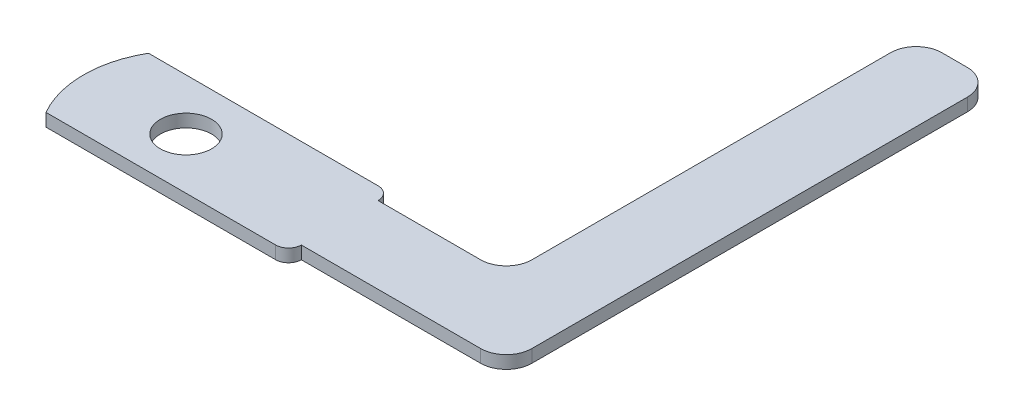
ISO-10303-21;
HEADER;
FILE_DESCRIPTION(('STEP AP214'),'2;1');
FILE_NAME('part.step','',(''),(''),'','','');
FILE_SCHEMA(('AUTOMOTIVE_DESIGN { 1 0 10303 214 1 1 1 1 }'));
ENDSEC;
DATA;
#1=APPLICATION_CONTEXT('core data for automotive mechanical design processes');
#2=APPLICATION_PROTOCOL_DEFINITION('international standard','automotive_design',2000,#1);
#3=PRODUCT_CONTEXT('',#1,'mechanical');
#4=PRODUCT('Part','Part','',(#3));
#5=PRODUCT_RELATED_PRODUCT_CATEGORY('part','',(#4));
#6=PRODUCT_DEFINITION_FORMATION('','',#4);
#7=PRODUCT_DEFINITION_CONTEXT('part definition',#1,'design');
#8=PRODUCT_DEFINITION('design','',#6,#7);
#9=PRODUCT_DEFINITION_SHAPE('','',#8);
#10=(LENGTH_UNIT() NAMED_UNIT(*) SI_UNIT(.MILLI.,.METRE.));
#11=(NAMED_UNIT(*) PLANE_ANGLE_UNIT() SI_UNIT($,.RADIAN.));
#12=(NAMED_UNIT(*) SI_UNIT($,.STERADIAN.) SOLID_ANGLE_UNIT());
#13=UNCERTAINTY_MEASURE_WITH_UNIT(LENGTH_MEASURE(1.E-05),#10,'distance_accuracy_value','');
#14=(GEOMETRIC_REPRESENTATION_CONTEXT(3) GLOBAL_UNCERTAINTY_ASSIGNED_CONTEXT((#13)) GLOBAL_UNIT_ASSIGNED_CONTEXT((#10,
#11,#12)) REPRESENTATION_CONTEXT('',''));
#15=CARTESIAN_POINT('',(0.,0.,0.));
#16=DIRECTION('',(0.,0.,1.));
#17=DIRECTION('',(1.,0.,0.));
#18=AXIS2_PLACEMENT_3D('',#15,#16,#17);
#19=CARTESIAN_POINT('',(0.,1.5875,-12.7));
#20=DIRECTION('',(0.,0.,1.));
#21=DIRECTION('',(1.,0.,0.));
#22=AXIS2_PLACEMENT_3D('',#19,#20,#21);
#23=PLANE('',#22);
#24=DIRECTION('',(-1.,0.,0.));
#25=VECTOR('',#24,1.);
#26=CARTESIAN_POINT('',(0.,1.5875,-12.7));
#27=LINE('',#26,#25);
#28=CARTESIAN_POINT('',(11.1125,1.5875,-12.7));
#29=VERTEX_POINT('',#28);
#30=CARTESIAN_POINT('',(-17.3485226280624,1.5875,-12.7));
#31=VERTEX_POINT('',#30);
#32=EDGE_CURVE('E143',#29,#31,#27,.T.);
#33=ORIENTED_EDGE('',*,*,#32,.F.);
#34=DIRECTION('',(0.,-1.,0.));
#35=VECTOR('',#34,1.);
#36=CARTESIAN_POINT('',(11.1125,0.,-12.7));
#37=LINE('',#36,#35);
#38=CARTESIAN_POINT('',(11.1125,0.,-12.7));
#39=VERTEX_POINT('',#38);
#40=EDGE_CURVE('E11',#29,#39,#37,.T.);
#41=ORIENTED_EDGE('',*,*,#40,.T.);
#42=DIRECTION('',(-1.,0.,0.));
#43=VECTOR('',#42,1.);
#44=CARTESIAN_POINT('',(0.,0.,-12.7));
#45=LINE('',#44,#43);
#46=CARTESIAN_POINT('',(-17.3485226280624,0.,-12.7));
#47=VERTEX_POINT('',#46);
#48=EDGE_CURVE('E165',#39,#47,#45,.T.);
#49=ORIENTED_EDGE('',*,*,#48,.T.);
#50=DIRECTION('',(0.,-1.,0.));
#51=VECTOR('',#50,1.);
#52=CARTESIAN_POINT('',(-17.3485226280624,1.5875,-12.7));
#53=LINE('',#52,#51);
#54=EDGE_CURVE('E158',#31,#47,#53,.T.);
#55=ORIENTED_EDGE('',*,*,#54,.F.);
#56=EDGE_LOOP('',(#33,#41,#49,#55));
#57=FACE_BOUND('',#56,.T.);
#58=ADVANCED_FACE('F41',(#57),#23,.F.);
#59=CARTESIAN_POINT('',(-6.35,1.5875,-6.35));
#60=DIRECTION('',(0.,-1.,0.));
#61=DIRECTION('',(0.,0.,-1.));
#62=AXIS2_PLACEMENT_3D('',#59,#60,#61);
#63=CYLINDRICAL_SURFACE('',#62,12.7);
#64=CARTESIAN_POINT('',(-6.35,0.,-6.35));
#65=DIRECTION('',(0.,1.,0.));
#66=DIRECTION('',(0.,0.,1.));
#67=AXIS2_PLACEMENT_3D('',#64,#65,#66);
#68=CIRCLE('',#67,12.7);
#69=CARTESIAN_POINT('',(-17.3485226280624,0.,0.));
#70=VERTEX_POINT('',#69);
#71=EDGE_CURVE('E282',#47,#70,#68,.T.);
#72=ORIENTED_EDGE('',*,*,#71,.T.);
#73=DIRECTION('',(0.,-1.,0.));
#74=VECTOR('',#73,1.);
#75=CARTESIAN_POINT('',(-17.3485226280624,1.5875,0.));
#76=LINE('',#75,#74);
#77=CARTESIAN_POINT('',(-17.3485226280624,1.5875,0.));
#78=VERTEX_POINT('',#77);
#79=EDGE_CURVE('E160',#78,#70,#76,.T.);
#80=ORIENTED_EDGE('',*,*,#79,.F.);
#81=CARTESIAN_POINT('',(-6.35,1.5875,-6.35));
#82=DIRECTION('',(0.,1.,0.));
#83=DIRECTION('',(0.,0.,1.));
#84=AXIS2_PLACEMENT_3D('',#81,#82,#83);
#85=CIRCLE('',#84,12.7);
#86=EDGE_CURVE('E146',#31,#78,#85,.T.);
#87=ORIENTED_EDGE('',*,*,#86,.F.);
#88=ORIENTED_EDGE('',*,*,#54,.T.);
#89=EDGE_LOOP('',(#72,#80,#87,#88));
#90=FACE_BOUND('',#89,.T.);
#91=ADVANCED_FACE('F157',(#90),#63,.T.);
#92=CARTESIAN_POINT('',(0.,1.5875,0.));
#93=DIRECTION('',(0.,0.,1.));
#94=DIRECTION('',(1.,0.,0.));
#95=AXIS2_PLACEMENT_3D('',#92,#93,#94);
#96=PLANE('',#95);
#97=DIRECTION('',(-1.,0.,0.));
#98=VECTOR('',#97,1.);
#99=CARTESIAN_POINT('',(0.,0.,0.));
#100=LINE('',#99,#98);
#101=CARTESIAN_POINT('',(11.1125,0.,0.));
#102=VERTEX_POINT('',#101);
#103=EDGE_CURVE('E279',#102,#70,#100,.T.);
#104=ORIENTED_EDGE('',*,*,#103,.F.);
#105=DIRECTION('',(0.,-1.,0.));
#106=VECTOR('',#105,1.);
#107=CARTESIAN_POINT('',(11.1125,1.5875,0.));
#108=LINE('',#107,#106);
#109=CARTESIAN_POINT('',(11.1125,1.5875,0.));
#110=VERTEX_POINT('',#109);
#111=EDGE_CURVE('E65',#102,#110,#108,.F.);
#112=ORIENTED_EDGE('',*,*,#111,.T.);
#113=DIRECTION('',(-1.,0.,0.));
#114=VECTOR('',#113,1.);
#115=CARTESIAN_POINT('',(0.,1.5875,0.));
#116=LINE('',#115,#114);
#117=EDGE_CURVE('E162',#110,#78,#116,.T.);
#118=ORIENTED_EDGE('',*,*,#117,.T.);
#119=ORIENTED_EDGE('',*,*,#79,.T.);
#120=EDGE_LOOP('',(#104,#112,#118,#119));
#121=FACE_BOUND('',#120,.T.);
#122=ADVANCED_FACE('F331',(#121),#96,.T.);
#123=CARTESIAN_POINT('',(0.,1.5875,-1.58749999999999));
#124=DIRECTION('',(0.,0.,1.));
#125=DIRECTION('',(1.,0.,0.));
#126=AXIS2_PLACEMENT_3D('',#123,#124,#125);
#127=PLANE('',#126);
#128=DIRECTION('',(-1.,0.,0.));
#129=VECTOR('',#128,1.);
#130=CARTESIAN_POINT('',(0.,0.,-1.58749999999999));
#131=LINE('',#130,#129);
#132=CARTESIAN_POINT('',(34.925,0.,-1.5875));
#133=VERTEX_POINT('',#132);
#134=CARTESIAN_POINT('',(12.7,0.,-1.5875));
#135=VERTEX_POINT('',#134);
#136=EDGE_CURVE('E276',#133,#135,#131,.T.);
#137=ORIENTED_EDGE('',*,*,#136,.F.);
#138=DIRECTION('',(0.,-1.,0.));
#139=VECTOR('',#138,1.);
#140=CARTESIAN_POINT('',(34.925,1.5875,-1.5875));
#141=LINE('',#140,#139);
#142=CARTESIAN_POINT('',(34.925,1.5875,-1.5875));
#143=VERTEX_POINT('',#142);
#144=EDGE_CURVE('E217',#133,#143,#141,.F.);
#145=ORIENTED_EDGE('',*,*,#144,.T.);
#146=DIRECTION('',(-1.,0.,0.));
#147=VECTOR('',#146,1.);
#148=CARTESIAN_POINT('',(0.,1.5875,-1.58749999999999));
#149=LINE('',#148,#147);
#150=CARTESIAN_POINT('',(12.7,1.5875,-1.5875));
#151=VERTEX_POINT('',#150);
#152=EDGE_CURVE('E239',#143,#151,#149,.T.);
#153=ORIENTED_EDGE('',*,*,#152,.T.);
#154=DIRECTION('',(0.,-1.,0.));
#155=VECTOR('',#154,1.);
#156=CARTESIAN_POINT('',(12.7,1.5875,-1.5875));
#157=LINE('',#156,#155);
#158=EDGE_CURVE('E174',#151,#135,#157,.T.);
#159=ORIENTED_EDGE('',*,*,#158,.T.);
#160=EDGE_LOOP('',(#137,#145,#153,#159));
#161=FACE_BOUND('',#160,.T.);
#162=ADVANCED_FACE('F246',(#161),#127,.T.);
#163=CARTESIAN_POINT('',(38.1,1.5875,0.));
#164=DIRECTION('',(1.,0.,0.));
#165=DIRECTION('',(0.,0.,-1.));
#166=AXIS2_PLACEMENT_3D('',#163,#164,#165);
#167=PLANE('',#166);
#168=DIRECTION('',(0.,0.,1.));
#169=VECTOR('',#168,1.);
#170=CARTESIAN_POINT('',(38.1,0.,0.));
#171=LINE('',#170,#169);
#172=CARTESIAN_POINT('',(38.1,0.,-58.7375));
#173=VERTEX_POINT('',#172);
#174=CARTESIAN_POINT('',(38.1,0.,-4.7625));
#175=VERTEX_POINT('',#174);
#176=EDGE_CURVE('E272',#173,#175,#171,.T.);
#177=ORIENTED_EDGE('',*,*,#176,.F.);
#178=DIRECTION('',(0.,-1.,0.));
#179=VECTOR('',#178,1.);
#180=CARTESIAN_POINT('',(38.1,1.5875,-58.7375));
#181=LINE('',#180,#179);
#182=CARTESIAN_POINT('',(38.1,1.5875,-58.7375));
#183=VERTEX_POINT('',#182);
#184=EDGE_CURVE('E194',#173,#183,#181,.F.);
#185=ORIENTED_EDGE('',*,*,#184,.T.);
#186=DIRECTION('',(0.,0.,1.));
#187=VECTOR('',#186,1.);
#188=CARTESIAN_POINT('',(38.1,1.5875,0.));
#189=LINE('',#188,#187);
#190=CARTESIAN_POINT('',(38.1,1.5875,-4.7625));
#191=VERTEX_POINT('',#190);
#192=EDGE_CURVE('E249',#183,#191,#189,.T.);
#193=ORIENTED_EDGE('',*,*,#192,.T.);
#194=DIRECTION('',(0.,-1.,0.));
#195=VECTOR('',#194,1.);
#196=CARTESIAN_POINT('',(38.1,1.5875,-4.7625));
#197=LINE('',#196,#195);
#198=EDGE_CURVE('E190',#191,#175,#197,.T.);
#199=ORIENTED_EDGE('',*,*,#198,.T.);
#200=EDGE_LOOP('',(#177,#185,#193,#199));
#201=FACE_BOUND('',#200,.T.);
#202=ADVANCED_FACE('F362',(#201),#167,.T.);
#203=CARTESIAN_POINT('',(0.,1.5875,-61.9125));
#204=DIRECTION('',(0.,0.,1.));
#205=DIRECTION('',(1.,0.,0.));
#206=AXIS2_PLACEMENT_3D('',#203,#204,#205);
#207=PLANE('',#206);
#208=DIRECTION('',(-1.,0.,0.));
#209=VECTOR('',#208,1.);
#210=CARTESIAN_POINT('',(0.,1.5875,-61.9125));
#211=LINE('',#210,#209);
#212=CARTESIAN_POINT('',(34.925,1.5875,-61.9125));
#213=VERTEX_POINT('',#212);
#214=CARTESIAN_POINT('',(31.75,1.5875,-61.9125));
#215=VERTEX_POINT('',#214);
#216=EDGE_CURVE('E298',#213,#215,#211,.T.);
#217=ORIENTED_EDGE('',*,*,#216,.F.);
#218=DIRECTION('',(0.,-1.,0.));
#219=VECTOR('',#218,1.);
#220=CARTESIAN_POINT('',(34.925,0.,-61.9125));
#221=LINE('',#220,#219);
#222=CARTESIAN_POINT('',(34.925,0.,-61.9125));
#223=VERTEX_POINT('',#222);
#224=EDGE_CURVE('E172',#213,#223,#221,.T.);
#225=ORIENTED_EDGE('',*,*,#224,.T.);
#226=DIRECTION('',(-1.,0.,0.));
#227=VECTOR('',#226,1.);
#228=CARTESIAN_POINT('',(0.,0.,-61.9125));
#229=LINE('',#228,#227);
#230=CARTESIAN_POINT('',(31.75,0.,-61.9125));
#231=VERTEX_POINT('',#230);
#232=EDGE_CURVE('E268',#223,#231,#229,.T.);
#233=ORIENTED_EDGE('',*,*,#232,.T.);
#234=DIRECTION('',(0.,-1.,0.));
#235=VECTOR('',#234,1.);
#236=CARTESIAN_POINT('',(31.75,1.5875,-61.9125));
#237=LINE('',#236,#235);
#238=EDGE_CURVE('E168',#231,#215,#237,.F.);
#239=ORIENTED_EDGE('',*,*,#238,.T.);
#240=EDGE_LOOP('',(#217,#225,#233,#239));
#241=FACE_BOUND('',#240,.T.);
#242=ADVANCED_FACE('F367',(#241),#207,.F.);
#243=CARTESIAN_POINT('',(28.575,1.5875,0.));
#244=DIRECTION('',(1.,0.,0.));
#245=DIRECTION('',(0.,0.,-1.));
#246=AXIS2_PLACEMENT_3D('',#243,#244,#245);
#247=PLANE('',#246);
#248=DIRECTION('',(0.,0.,1.));
#249=VECTOR('',#248,1.);
#250=CARTESIAN_POINT('',(28.575,1.5875,0.));
#251=LINE('',#250,#249);
#252=CARTESIAN_POINT('',(28.575,1.5875,-58.7375));
#253=VERTEX_POINT('',#252);
#254=CARTESIAN_POINT('',(28.575,1.5875,-14.2875));
#255=VERTEX_POINT('',#254);
#256=EDGE_CURVE('E294',#253,#255,#251,.T.);
#257=ORIENTED_EDGE('',*,*,#256,.F.);
#258=DIRECTION('',(0.,-1.,0.));
#259=VECTOR('',#258,1.);
#260=CARTESIAN_POINT('',(28.575,1.5875,-58.7375));
#261=LINE('',#260,#259);
#262=CARTESIAN_POINT('',(28.575,0.,-58.7375));
#263=VERTEX_POINT('',#262);
#264=EDGE_CURVE('E209',#253,#263,#261,.T.);
#265=ORIENTED_EDGE('',*,*,#264,.T.);
#266=DIRECTION('',(0.,0.,1.));
#267=VECTOR('',#266,1.);
#268=CARTESIAN_POINT('',(28.575,0.,0.));
#269=LINE('',#268,#267);
#270=CARTESIAN_POINT('',(28.575,0.,-14.2875));
#271=VERTEX_POINT('',#270);
#272=EDGE_CURVE('E264',#263,#271,#269,.T.);
#273=ORIENTED_EDGE('',*,*,#272,.T.);
#274=DIRECTION('',(0.,-1.,0.));
#275=VECTOR('',#274,1.);
#276=CARTESIAN_POINT('',(28.575,1.5875,-14.2875));
#277=LINE('',#276,#275);
#278=EDGE_CURVE('E206',#271,#255,#277,.F.);
#279=ORIENTED_EDGE('',*,*,#278,.T.);
#280=EDGE_LOOP('',(#257,#265,#273,#279));
#281=FACE_BOUND('',#280,.T.);
#282=ADVANCED_FACE('F371',(#281),#247,.F.);
#283=CARTESIAN_POINT('',(0.,1.5875,-11.1125));
#284=DIRECTION('',(0.,0.,-1.));
#285=DIRECTION('',(-1.,0.,0.));
#286=AXIS2_PLACEMENT_3D('',#283,#284,#285);
#287=PLANE('',#286);
#288=DIRECTION('',(1.,0.,0.));
#289=VECTOR('',#288,1.);
#290=CARTESIAN_POINT('',(0.,1.5875,-11.1125));
#291=LINE('',#290,#289);
#292=CARTESIAN_POINT('',(12.7,1.5875,-11.1125));
#293=VERTEX_POINT('',#292);
#294=CARTESIAN_POINT('',(25.4,1.5875,-11.1125));
#295=VERTEX_POINT('',#294);
#296=EDGE_CURVE('E257',#293,#295,#291,.T.);
#297=ORIENTED_EDGE('',*,*,#296,.T.);
#298=DIRECTION('',(0.,-1.,0.));
#299=VECTOR('',#298,1.);
#300=CARTESIAN_POINT('',(25.4,1.5875,-11.1125));
#301=LINE('',#300,#299);
#302=CARTESIAN_POINT('',(25.4,0.,-11.1125));
#303=VERTEX_POINT('',#302);
#304=EDGE_CURVE('E213',#295,#303,#301,.T.);
#305=ORIENTED_EDGE('',*,*,#304,.T.);
#306=DIRECTION('',(1.,0.,0.));
#307=VECTOR('',#306,1.);
#308=CARTESIAN_POINT('',(0.,0.,-11.1125));
#309=LINE('',#308,#307);
#310=CARTESIAN_POINT('',(12.7,0.,-11.1125));
#311=VERTEX_POINT('',#310);
#312=EDGE_CURVE('E260',#311,#303,#309,.T.);
#313=ORIENTED_EDGE('',*,*,#312,.F.);
#314=DIRECTION('',(0.,-1.,0.));
#315=VECTOR('',#314,1.);
#316=CARTESIAN_POINT('',(12.7,1.5875,-11.1125));
#317=LINE('',#316,#315);
#318=EDGE_CURVE('E254',#293,#311,#317,.T.);
#319=ORIENTED_EDGE('',*,*,#318,.F.);
#320=EDGE_LOOP('',(#297,#305,#313,#319));
#321=FACE_BOUND('',#320,.T.);
#322=ADVANCED_FACE('F324',(#321),#287,.T.);
#323=CARTESIAN_POINT('',(-6.35,1.5875,-6.35));
#324=DIRECTION('',(0.,-1.,0.));
#325=DIRECTION('',(0.,0.,-1.));
#326=AXIS2_PLACEMENT_3D('',#323,#324,#325);
#327=CYLINDRICAL_SURFACE('',#326,3.175);
#328=CARTESIAN_POINT('',(-6.35,1.5875,-6.35));
#329=DIRECTION('',(0.,1.,0.));
#330=DIRECTION('',(0.,0.,1.));
#331=AXIS2_PLACEMENT_3D('',#328,#329,#330);
#332=CIRCLE('',#331,3.175);
#333=CARTESIAN_POINT('',(-6.35,1.5875,-3.175));
#334=VERTEX_POINT('',#333);
#335=EDGE_CURVE('E152',#334,#334,#332,.T.);
#336=ORIENTED_EDGE('',*,*,#335,.T.);
#337=EDGE_LOOP('',(#336));
#338=FACE_BOUND('',#337,.T.);
#339=CARTESIAN_POINT('',(-6.35,0.,-6.35));
#340=DIRECTION('',(0.,1.,0.));
#341=DIRECTION('',(0.,0.,1.));
#342=AXIS2_PLACEMENT_3D('',#339,#340,#341);
#343=CIRCLE('',#342,3.175);
#344=CARTESIAN_POINT('',(-6.35,0.,-3.175));
#345=VERTEX_POINT('',#344);
#346=EDGE_CURVE('E287',#345,#345,#343,.T.);
#347=ORIENTED_EDGE('',*,*,#346,.F.);
#348=EDGE_LOOP('',(#347));
#349=FACE_BOUND('',#348,.T.);
#350=ADVANCED_FACE('F311',(#338,#349),#327,.F.);
#351=CARTESIAN_POINT('',(0.,1.5875,0.));
#352=DIRECTION('',(0.,1.,0.));
#353=DIRECTION('',(0.,0.,1.));
#354=AXIS2_PLACEMENT_3D('',#351,#352,#353);
#355=PLANE('',#354);
#356=ORIENTED_EDGE('',*,*,#335,.F.);
#357=EDGE_LOOP('',(#356));
#358=FACE_BOUND('',#357,.T.);
#359=ORIENTED_EDGE('',*,*,#117,.F.);
#360=CARTESIAN_POINT('',(11.1125,1.5875,-1.5875));
#361=DIRECTION('',(0.,1.,0.));
#362=DIRECTION('',(0.,0.,1.));
#363=AXIS2_PLACEMENT_3D('',#360,#361,#362);
#364=CIRCLE('',#363,1.5875);
#365=EDGE_CURVE('E50',#110,#151,#364,.T.);
#366=ORIENTED_EDGE('',*,*,#365,.T.);
#367=ORIENTED_EDGE('',*,*,#152,.F.);
#368=CARTESIAN_POINT('',(34.925,1.5875,-4.7625));
#369=DIRECTION('',(0.,1.,0.));
#370=DIRECTION('',(0.,0.,1.));
#371=AXIS2_PLACEMENT_3D('',#368,#369,#370);
#372=CIRCLE('',#371,3.175);
#373=EDGE_CURVE('E197',#143,#191,#372,.T.);
#374=ORIENTED_EDGE('',*,*,#373,.T.);
#375=ORIENTED_EDGE('',*,*,#192,.F.);
#376=CARTESIAN_POINT('',(34.925,1.5875,-58.7375));
#377=DIRECTION('',(0.,1.,0.));
#378=DIRECTION('',(0.,0.,1.));
#379=AXIS2_PLACEMENT_3D('',#376,#377,#378);
#380=CIRCLE('',#379,3.175);
#381=EDGE_CURVE('E203',#183,#213,#380,.T.);
#382=ORIENTED_EDGE('',*,*,#381,.T.);
#383=ORIENTED_EDGE('',*,*,#216,.T.);
#384=CARTESIAN_POINT('',(31.75,1.5875,-58.7375));
#385=DIRECTION('',(0.,1.,0.));
#386=DIRECTION('',(0.,0.,1.));
#387=AXIS2_PLACEMENT_3D('',#384,#385,#386);
#388=CIRCLE('',#387,3.175);
#389=EDGE_CURVE('E200',#215,#253,#388,.T.);
#390=ORIENTED_EDGE('',*,*,#389,.T.);
#391=ORIENTED_EDGE('',*,*,#256,.T.);
#392=CARTESIAN_POINT('',(25.4,1.5875,-14.2875));
#393=DIRECTION('',(0.,1.,0.));
#394=DIRECTION('',(0.,0.,1.));
#395=AXIS2_PLACEMENT_3D('',#392,#393,#394);
#396=CIRCLE('',#395,3.175);
#397=EDGE_CURVE('E223',#255,#295,#396,.F.);
#398=ORIENTED_EDGE('',*,*,#397,.T.);
#399=ORIENTED_EDGE('',*,*,#296,.F.);
#400=CARTESIAN_POINT('',(11.1125,1.5875,-11.1125));
#401=DIRECTION('',(0.,1.,0.));
#402=DIRECTION('',(0.,0.,1.));
#403=AXIS2_PLACEMENT_3D('',#400,#401,#402);
#404=CIRCLE('',#403,1.5875);
#405=EDGE_CURVE('E57',#293,#29,#404,.T.);
#406=ORIENTED_EDGE('',*,*,#405,.T.);
#407=ORIENTED_EDGE('',*,*,#32,.T.);
#408=ORIENTED_EDGE('',*,*,#86,.T.);
#409=EDGE_LOOP('',(#359,#366,#367,#374,#375,#382,#383,#390,#391,#398,#399,#406,#407,#408));
#410=FACE_BOUND('',#409,.T.);
#411=ADVANCED_FACE('F145',(#358,#410),#355,.T.);
#412=CARTESIAN_POINT('',(0.,0.,0.));
#413=DIRECTION('',(0.,1.,0.));
#414=DIRECTION('',(0.,0.,1.));
#415=AXIS2_PLACEMENT_3D('',#412,#413,#414);
#416=PLANE('',#415);
#417=ORIENTED_EDGE('',*,*,#346,.T.);
#418=EDGE_LOOP('',(#417));
#419=FACE_BOUND('',#418,.T.);
#420=ORIENTED_EDGE('',*,*,#136,.T.);
#421=CARTESIAN_POINT('',(11.1125,0.,-1.5875));
#422=DIRECTION('',(0.,1.,0.));
#423=DIRECTION('',(0.,0.,1.));
#424=AXIS2_PLACEMENT_3D('',#421,#422,#423);
#425=CIRCLE('',#424,1.5875);
#426=EDGE_CURVE('E229',#135,#102,#425,.F.);
#427=ORIENTED_EDGE('',*,*,#426,.T.);
#428=ORIENTED_EDGE('',*,*,#103,.T.);
#429=ORIENTED_EDGE('',*,*,#71,.F.);
#430=ORIENTED_EDGE('',*,*,#48,.F.);
#431=CARTESIAN_POINT('',(11.1125,0.,-11.1125));
#432=DIRECTION('',(0.,1.,0.));
#433=DIRECTION('',(0.,0.,1.));
#434=AXIS2_PLACEMENT_3D('',#431,#432,#433);
#435=CIRCLE('',#434,1.5875);
#436=EDGE_CURVE('E226',#39,#311,#435,.F.);
#437=ORIENTED_EDGE('',*,*,#436,.T.);
#438=ORIENTED_EDGE('',*,*,#312,.T.);
#439=CARTESIAN_POINT('',(25.4,0.,-14.2875));
#440=DIRECTION('',(0.,1.,0.));
#441=DIRECTION('',(0.,0.,1.));
#442=AXIS2_PLACEMENT_3D('',#439,#440,#441);
#443=CIRCLE('',#442,3.175);
#444=EDGE_CURVE('E220',#303,#271,#443,.T.);
#445=ORIENTED_EDGE('',*,*,#444,.T.);
#446=ORIENTED_EDGE('',*,*,#272,.F.);
#447=CARTESIAN_POINT('',(31.75,0.,-58.7375));
#448=DIRECTION('',(0.,1.,0.));
#449=DIRECTION('',(0.,0.,1.));
#450=AXIS2_PLACEMENT_3D('',#447,#448,#449);
#451=CIRCLE('',#450,3.175);
#452=EDGE_CURVE('E184',#263,#231,#451,.F.);
#453=ORIENTED_EDGE('',*,*,#452,.T.);
#454=ORIENTED_EDGE('',*,*,#232,.F.);
#455=CARTESIAN_POINT('',(34.925,0.,-58.7375));
#456=DIRECTION('',(0.,1.,0.));
#457=DIRECTION('',(0.,0.,1.));
#458=AXIS2_PLACEMENT_3D('',#455,#456,#457);
#459=CIRCLE('',#458,3.175);
#460=EDGE_CURVE('E187',#223,#173,#459,.F.);
#461=ORIENTED_EDGE('',*,*,#460,.T.);
#462=ORIENTED_EDGE('',*,*,#176,.T.);
#463=CARTESIAN_POINT('',(34.925,0.,-4.7625));
#464=DIRECTION('',(0.,1.,0.));
#465=DIRECTION('',(0.,0.,1.));
#466=AXIS2_PLACEMENT_3D('',#463,#464,#465);
#467=CIRCLE('',#466,3.175);
#468=EDGE_CURVE('E181',#175,#133,#467,.F.);
#469=ORIENTED_EDGE('',*,*,#468,.T.);
#470=EDGE_LOOP('',(#420,#427,#428,#429,#430,#437,#438,#445,#446,#453,#454,#461,#462,#469));
#471=FACE_BOUND('',#470,.T.);
#472=ADVANCED_FACE('F315',(#419,#471),#416,.F.);
#473=CARTESIAN_POINT('',(34.925,1.5875,-58.7375));
#474=DIRECTION('',(0.,1.,0.));
#475=DIRECTION('',(0.,0.,1.));
#476=AXIS2_PLACEMENT_3D('',#473,#474,#475);
#477=CYLINDRICAL_SURFACE('',#476,3.175);
#478=ORIENTED_EDGE('',*,*,#381,.F.);
#479=ORIENTED_EDGE('',*,*,#184,.F.);
#480=ORIENTED_EDGE('',*,*,#460,.F.);
#481=ORIENTED_EDGE('',*,*,#224,.F.);
#482=EDGE_LOOP('',(#478,#479,#480,#481));
#483=FACE_BOUND('',#482,.T.);
#484=ADVANCED_FACE('F321',(#483),#477,.T.);
#485=CARTESIAN_POINT('',(31.75,1.5875,-58.7375));
#486=DIRECTION('',(0.,-1.,0.));
#487=DIRECTION('',(0.,0.,-1.));
#488=AXIS2_PLACEMENT_3D('',#485,#486,#487);
#489=CYLINDRICAL_SURFACE('',#488,3.175);
#490=ORIENTED_EDGE('',*,*,#389,.F.);
#491=ORIENTED_EDGE('',*,*,#238,.F.);
#492=ORIENTED_EDGE('',*,*,#452,.F.);
#493=ORIENTED_EDGE('',*,*,#264,.F.);
#494=EDGE_LOOP('',(#490,#491,#492,#493));
#495=FACE_BOUND('',#494,.T.);
#496=ADVANCED_FACE('F337',(#495),#489,.T.);
#497=CARTESIAN_POINT('',(25.4,1.5875,-14.2875));
#498=DIRECTION('',(0.,-1.,0.));
#499=DIRECTION('',(0.,0.,-1.));
#500=AXIS2_PLACEMENT_3D('',#497,#498,#499);
#501=CYLINDRICAL_SURFACE('',#500,3.175);
#502=ORIENTED_EDGE('',*,*,#397,.F.);
#503=ORIENTED_EDGE('',*,*,#278,.F.);
#504=ORIENTED_EDGE('',*,*,#444,.F.);
#505=ORIENTED_EDGE('',*,*,#304,.F.);
#506=EDGE_LOOP('',(#502,#503,#504,#505));
#507=FACE_BOUND('',#506,.T.);
#508=ADVANCED_FACE('F341',(#507),#501,.F.);
#509=CARTESIAN_POINT('',(34.925,1.5875,-4.7625));
#510=DIRECTION('',(0.,-1.,0.));
#511=DIRECTION('',(0.,0.,-1.));
#512=AXIS2_PLACEMENT_3D('',#509,#510,#511);
#513=CYLINDRICAL_SURFACE('',#512,3.175);
#514=ORIENTED_EDGE('',*,*,#373,.F.);
#515=ORIENTED_EDGE('',*,*,#144,.F.);
#516=ORIENTED_EDGE('',*,*,#468,.F.);
#517=ORIENTED_EDGE('',*,*,#198,.F.);
#518=EDGE_LOOP('',(#514,#515,#516,#517));
#519=FACE_BOUND('',#518,.T.);
#520=ADVANCED_FACE('F345',(#519),#513,.T.);
#521=CARTESIAN_POINT('',(11.1125,1.5875,-1.5875));
#522=DIRECTION('',(0.,-1.,0.));
#523=DIRECTION('',(0.,0.,-1.));
#524=AXIS2_PLACEMENT_3D('',#521,#522,#523);
#525=CYLINDRICAL_SURFACE('',#524,1.5875);
#526=ORIENTED_EDGE('',*,*,#365,.F.);
#527=ORIENTED_EDGE('',*,*,#111,.F.);
#528=ORIENTED_EDGE('',*,*,#426,.F.);
#529=ORIENTED_EDGE('',*,*,#158,.F.);
#530=EDGE_LOOP('',(#526,#527,#528,#529));
#531=FACE_BOUND('',#530,.T.);
#532=ADVANCED_FACE('F251',(#531),#525,.T.);
#533=CARTESIAN_POINT('',(11.1125,1.5875,-11.1125));
#534=DIRECTION('',(0.,1.,0.));
#535=DIRECTION('',(0.,0.,1.));
#536=AXIS2_PLACEMENT_3D('',#533,#534,#535);
#537=CYLINDRICAL_SURFACE('',#536,1.5875);
#538=ORIENTED_EDGE('',*,*,#405,.F.);
#539=ORIENTED_EDGE('',*,*,#318,.T.);
#540=ORIENTED_EDGE('',*,*,#436,.F.);
#541=ORIENTED_EDGE('',*,*,#40,.F.);
#542=EDGE_LOOP('',(#538,#539,#540,#541));
#543=FACE_BOUND('',#542,.T.);
#544=ADVANCED_FACE('F43',(#543),#537,.T.);
#545=CLOSED_SHELL('',(#58,#91,#122,#162,#202,#242,#282,#322,#350,#411,#472,#484,#496,#508,#520,
#532,#544));
#546=MANIFOLD_SOLID_BREP('B2',#545);
#547=ADVANCED_BREP_SHAPE_REPRESENTATION('',(#18,#546),#14);
#548=SHAPE_DEFINITION_REPRESENTATION(#9,#547);
ENDSEC;
END-ISO-10303-21;
